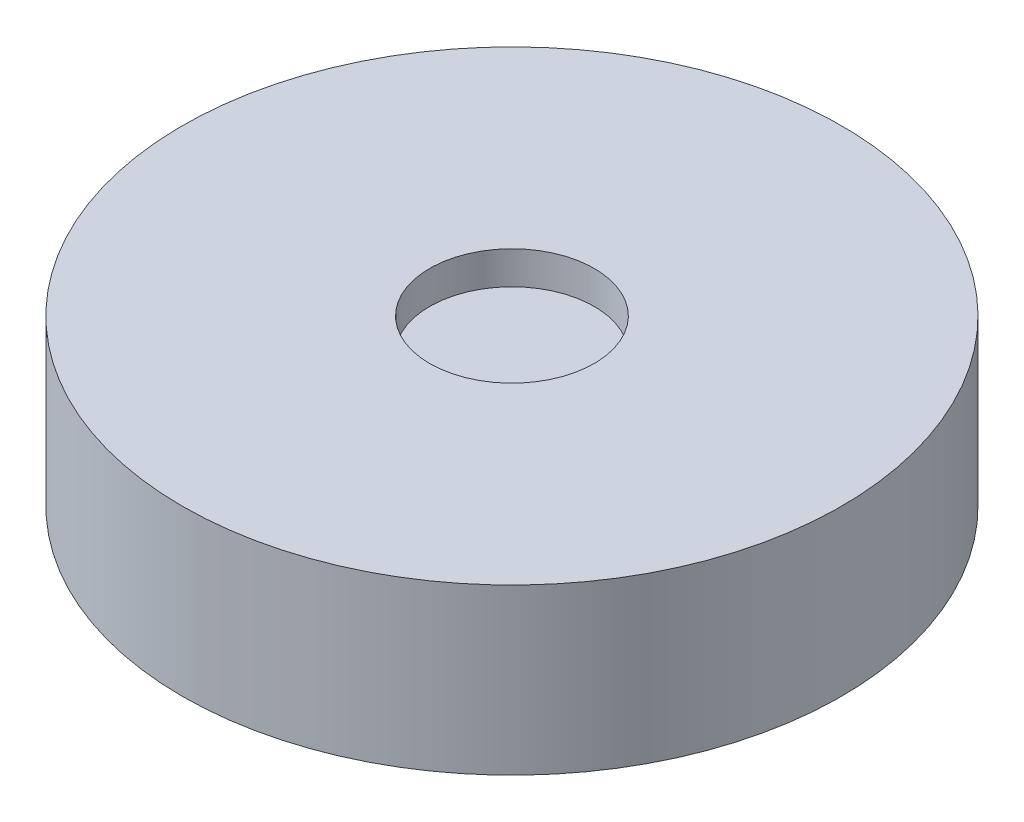
ISO-10303-21;
HEADER;
FILE_DESCRIPTION(('STEP AP214'),'2;1');
FILE_NAME('part.step','',(''),(''),'','','');
FILE_SCHEMA(('AUTOMOTIVE_DESIGN { 1 0 10303 214 1 1 1 1 }'));
ENDSEC;
DATA;
#1=APPLICATION_CONTEXT('core data for automotive mechanical design processes');
#2=APPLICATION_PROTOCOL_DEFINITION('international standard','automotive_design',2000,#1);
#3=PRODUCT_CONTEXT('',#1,'mechanical');
#4=PRODUCT('Part','Part','',(#3));
#5=PRODUCT_RELATED_PRODUCT_CATEGORY('part','',(#4));
#6=PRODUCT_DEFINITION_FORMATION('','',#4);
#7=PRODUCT_DEFINITION_CONTEXT('part definition',#1,'design');
#8=PRODUCT_DEFINITION('design','',#6,#7);
#9=PRODUCT_DEFINITION_SHAPE('','',#8);
#10=(LENGTH_UNIT() NAMED_UNIT(*) SI_UNIT(.MILLI.,.METRE.));
#11=(NAMED_UNIT(*) PLANE_ANGLE_UNIT() SI_UNIT($,.RADIAN.));
#12=(NAMED_UNIT(*) SI_UNIT($,.STERADIAN.) SOLID_ANGLE_UNIT());
#13=UNCERTAINTY_MEASURE_WITH_UNIT(LENGTH_MEASURE(1.E-05),#10,'distance_accuracy_value','');
#14=(GEOMETRIC_REPRESENTATION_CONTEXT(3) GLOBAL_UNCERTAINTY_ASSIGNED_CONTEXT((#13)) GLOBAL_UNIT_ASSIGNED_CONTEXT((#10,
#11,#12)) REPRESENTATION_CONTEXT('',''));
#15=CARTESIAN_POINT('',(0.,0.,0.));
#16=DIRECTION('',(0.,0.,1.));
#17=DIRECTION('',(1.,0.,0.));
#18=AXIS2_PLACEMENT_3D('',#15,#16,#17);
#19=CARTESIAN_POINT('',(0.,25.4,0.));
#20=DIRECTION('',(0.,-1.,0.));
#21=DIRECTION('',(0.,0.,-1.));
#22=AXIS2_PLACEMENT_3D('',#19,#20,#21);
#23=CYLINDRICAL_SURFACE('',#22,50.8316535021452);
#24=CARTESIAN_POINT('',(0.,25.4,0.));
#25=DIRECTION('',(0.,1.,0.));
#26=DIRECTION('',(0.,0.,1.));
#27=AXIS2_PLACEMENT_3D('',#24,#25,#26);
#28=CIRCLE('',#27,50.8316535021452);
#29=CARTESIAN_POINT('',(0.,25.4,50.8316535021452));
#30=VERTEX_POINT('',#29);
#31=EDGE_CURVE('E10',#30,#30,#28,.T.);
#32=ORIENTED_EDGE('',*,*,#31,.F.);
#33=EDGE_LOOP('',(#32));
#34=FACE_BOUND('',#33,.T.);
#35=CARTESIAN_POINT('',(0.,0.,0.));
#36=DIRECTION('',(0.,1.,0.));
#37=DIRECTION('',(0.,0.,1.));
#38=AXIS2_PLACEMENT_3D('',#35,#36,#37);
#39=CIRCLE('',#38,50.8316535021452);
#40=CARTESIAN_POINT('',(0.,0.,50.8316535021452));
#41=VERTEX_POINT('',#40);
#42=EDGE_CURVE('E36',#41,#41,#39,.T.);
#43=ORIENTED_EDGE('',*,*,#42,.T.);
#44=EDGE_LOOP('',(#43));
#45=FACE_BOUND('',#44,.T.);
#46=ADVANCED_FACE('F33',(#34,#45),#23,.T.);
#47=CARTESIAN_POINT('',(0.,25.4,0.));
#48=DIRECTION('',(0.,1.,0.));
#49=DIRECTION('',(0.,0.,1.));
#50=AXIS2_PLACEMENT_3D('',#47,#48,#49);
#51=PLANE('',#50);
#52=CARTESIAN_POINT('',(0.,25.4,0.));
#53=DIRECTION('',(0.,1.,0.));
#54=DIRECTION('',(0.,0.,1.));
#55=AXIS2_PLACEMENT_3D('',#52,#53,#54);
#56=CIRCLE('',#55,12.7);
#57=CARTESIAN_POINT('',(0.,25.4,12.7));
#58=VERTEX_POINT('',#57);
#59=EDGE_CURVE('E45',#58,#58,#56,.T.);
#60=ORIENTED_EDGE('',*,*,#59,.F.);
#61=EDGE_LOOP('',(#60));
#62=FACE_BOUND('',#61,.T.);
#63=ORIENTED_EDGE('',*,*,#31,.T.);
#64=EDGE_LOOP('',(#63));
#65=FACE_BOUND('',#64,.T.);
#66=ADVANCED_FACE('F60',(#62,#65),#51,.T.);
#67=CARTESIAN_POINT('',(0.,0.,0.));
#68=DIRECTION('',(0.,1.,0.));
#69=DIRECTION('',(0.,0.,1.));
#70=AXIS2_PLACEMENT_3D('',#67,#68,#69);
#71=PLANE('',#70);
#72=ORIENTED_EDGE('',*,*,#42,.F.);
#73=EDGE_LOOP('',(#72));
#74=FACE_BOUND('',#73,.T.);
#75=ADVANCED_FACE('F56',(#74),#71,.F.);
#76=CARTESIAN_POINT('',(0.,20.32,0.));
#77=DIRECTION('',(0.,1.,0.));
#78=DIRECTION('',(0.,0.,1.));
#79=AXIS2_PLACEMENT_3D('',#76,#77,#78);
#80=CYLINDRICAL_SURFACE('',#79,12.7);
#81=CARTESIAN_POINT('',(0.,20.32,0.));
#82=DIRECTION('',(0.,1.,0.));
#83=DIRECTION('',(0.,0.,1.));
#84=AXIS2_PLACEMENT_3D('',#81,#82,#83);
#85=CIRCLE('',#84,12.7);
#86=CARTESIAN_POINT('',(0.,20.32,12.7));
#87=VERTEX_POINT('',#86);
#88=EDGE_CURVE('E43',#87,#87,#85,.T.);
#89=ORIENTED_EDGE('',*,*,#88,.F.);
#90=EDGE_LOOP('',(#89));
#91=FACE_BOUND('',#90,.T.);
#92=ORIENTED_EDGE('',*,*,#59,.T.);
#93=EDGE_LOOP('',(#92));
#94=FACE_BOUND('',#93,.T.);
#95=ADVANCED_FACE('F53',(#91,#94),#80,.F.);
#96=CARTESIAN_POINT('',(0.,20.32,0.));
#97=DIRECTION('',(0.,1.,0.));
#98=DIRECTION('',(0.,0.,1.));
#99=AXIS2_PLACEMENT_3D('',#96,#97,#98);
#100=PLANE('',#99);
#101=ORIENTED_EDGE('',*,*,#88,.T.);
#102=EDGE_LOOP('',(#101));
#103=FACE_BOUND('',#102,.T.);
#104=ADVANCED_FACE('F51',(#103),#100,.T.);
#105=CLOSED_SHELL('',(#46,#66,#75,#95,#104));
#106=MANIFOLD_SOLID_BREP('B2',#105);
#107=ADVANCED_BREP_SHAPE_REPRESENTATION('',(#18,#106),#14);
#108=SHAPE_DEFINITION_REPRESENTATION(#9,#107);
ENDSEC;
END-ISO-10303-21;
